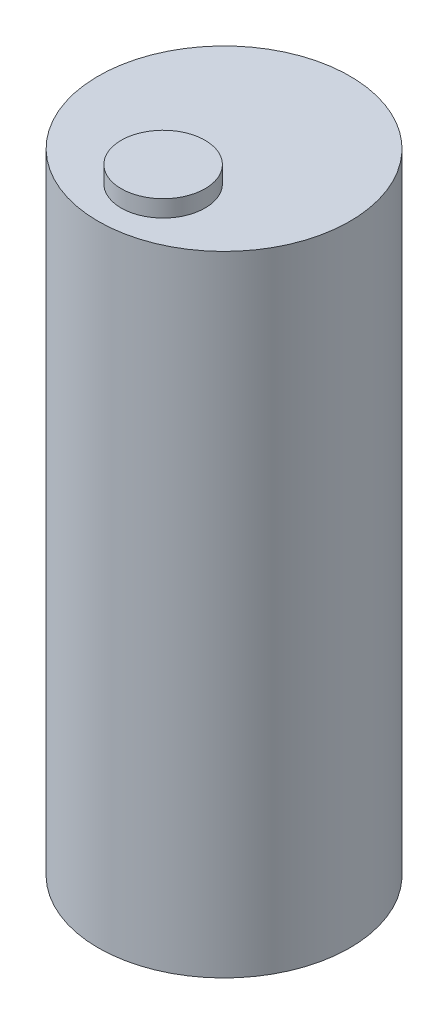
ISO-10303-21;
HEADER;
FILE_DESCRIPTION(('STEP AP214'),'2;1');
FILE_NAME('part.step','',(''),(''),'','','');
FILE_SCHEMA(('AUTOMOTIVE_DESIGN { 1 0 10303 214 1 1 1 1 }'));
ENDSEC;
DATA;
#1=APPLICATION_CONTEXT('core data for automotive mechanical design processes');
#2=APPLICATION_PROTOCOL_DEFINITION('international standard','automotive_design',2000,#1);
#3=PRODUCT_CONTEXT('',#1,'mechanical');
#4=PRODUCT('Part','Part','',(#3));
#5=PRODUCT_RELATED_PRODUCT_CATEGORY('part','',(#4));
#6=PRODUCT_DEFINITION_FORMATION('','',#4);
#7=PRODUCT_DEFINITION_CONTEXT('part definition',#1,'design');
#8=PRODUCT_DEFINITION('design','',#6,#7);
#9=PRODUCT_DEFINITION_SHAPE('','',#8);
#10=(LENGTH_UNIT() NAMED_UNIT(*) SI_UNIT(.MILLI.,.METRE.));
#11=(NAMED_UNIT(*) PLANE_ANGLE_UNIT() SI_UNIT($,.RADIAN.));
#12=(NAMED_UNIT(*) SI_UNIT($,.STERADIAN.) SOLID_ANGLE_UNIT());
#13=UNCERTAINTY_MEASURE_WITH_UNIT(LENGTH_MEASURE(1.E-05),#10,'distance_accuracy_value','');
#14=(GEOMETRIC_REPRESENTATION_CONTEXT(3) GLOBAL_UNCERTAINTY_ASSIGNED_CONTEXT((#13)) GLOBAL_UNIT_ASSIGNED_CONTEXT((#10,
#11,#12)) REPRESENTATION_CONTEXT('',''));
#15=CARTESIAN_POINT('',(0.,0.,0.));
#16=DIRECTION('',(0.,0.,1.));
#17=DIRECTION('',(1.,0.,0.));
#18=AXIS2_PLACEMENT_3D('',#15,#16,#17);
#19=CARTESIAN_POINT('',(0.,75.,0.));
#20=DIRECTION('',(0.,-1.,0.));
#21=DIRECTION('',(0.,0.,-1.));
#22=AXIS2_PLACEMENT_3D('',#19,#20,#21);
#23=CYLINDRICAL_SURFACE('',#22,15.);
#24=CARTESIAN_POINT('',(0.,75.,0.));
#25=DIRECTION('',(0.,1.,0.));
#26=DIRECTION('',(0.,0.,1.));
#27=AXIS2_PLACEMENT_3D('',#24,#25,#26);
#28=CIRCLE('',#27,15.);
#29=CARTESIAN_POINT('',(0.,75.,15.));
#30=VERTEX_POINT('',#29);
#31=EDGE_CURVE('E10',#30,#30,#28,.T.);
#32=ORIENTED_EDGE('',*,*,#31,.F.);
#33=EDGE_LOOP('',(#32));
#34=FACE_BOUND('',#33,.T.);
#35=CARTESIAN_POINT('',(0.,0.,0.));
#36=DIRECTION('',(0.,1.,0.));
#37=DIRECTION('',(0.,0.,1.));
#38=AXIS2_PLACEMENT_3D('',#35,#36,#37);
#39=CIRCLE('',#38,15.);
#40=CARTESIAN_POINT('',(0.,0.,15.));
#41=VERTEX_POINT('',#40);
#42=EDGE_CURVE('E33',#41,#41,#39,.T.);
#43=ORIENTED_EDGE('',*,*,#42,.T.);
#44=EDGE_LOOP('',(#43));
#45=FACE_BOUND('',#44,.T.);
#46=ADVANCED_FACE('F30',(#34,#45),#23,.T.);
#47=CARTESIAN_POINT('',(0.,75.,0.));
#48=DIRECTION('',(0.,1.,0.));
#49=DIRECTION('',(0.,0.,1.));
#50=AXIS2_PLACEMENT_3D('',#47,#48,#49);
#51=PLANE('',#50);
#52=CARTESIAN_POINT('',(0.,75.,7.25976365104941));
#53=DIRECTION('',(0.,1.,0.));
#54=DIRECTION('',(0.,0.,1.));
#55=AXIS2_PLACEMENT_3D('',#52,#53,#54);
#56=CIRCLE('',#55,5.);
#57=CARTESIAN_POINT('',(0.,75.,12.2597636510494));
#58=VERTEX_POINT('',#57);
#59=EDGE_CURVE('E42',#58,#58,#56,.T.);
#60=ORIENTED_EDGE('',*,*,#59,.F.);
#61=EDGE_LOOP('',(#60));
#62=FACE_BOUND('',#61,.T.);
#63=ORIENTED_EDGE('',*,*,#31,.T.);
#64=EDGE_LOOP('',(#63));
#65=FACE_BOUND('',#64,.T.);
#66=ADVANCED_FACE('F57',(#62,#65),#51,.T.);
#67=CARTESIAN_POINT('',(0.,0.,0.));
#68=DIRECTION('',(0.,1.,0.));
#69=DIRECTION('',(0.,0.,1.));
#70=AXIS2_PLACEMENT_3D('',#67,#68,#69);
#71=PLANE('',#70);
#72=ORIENTED_EDGE('',*,*,#42,.F.);
#73=EDGE_LOOP('',(#72));
#74=FACE_BOUND('',#73,.T.);
#75=ADVANCED_FACE('F53',(#74),#71,.F.);
#76=CARTESIAN_POINT('',(0.,77.,7.25976365104941));
#77=DIRECTION('',(0.,-1.,0.));
#78=DIRECTION('',(0.,0.,-1.));
#79=AXIS2_PLACEMENT_3D('',#76,#77,#78);
#80=CYLINDRICAL_SURFACE('',#79,5.);
#81=CARTESIAN_POINT('',(0.,77.,7.25976365104941));
#82=DIRECTION('',(0.,1.,0.));
#83=DIRECTION('',(0.,0.,1.));
#84=AXIS2_PLACEMENT_3D('',#81,#82,#83);
#85=CIRCLE('',#84,5.);
#86=CARTESIAN_POINT('',(0.,77.,12.2597636510494));
#87=VERTEX_POINT('',#86);
#88=EDGE_CURVE('E40',#87,#87,#85,.T.);
#89=ORIENTED_EDGE('',*,*,#88,.F.);
#90=EDGE_LOOP('',(#89));
#91=FACE_BOUND('',#90,.T.);
#92=ORIENTED_EDGE('',*,*,#59,.T.);
#93=EDGE_LOOP('',(#92));
#94=FACE_BOUND('',#93,.T.);
#95=ADVANCED_FACE('F50',(#91,#94),#80,.T.);
#96=CARTESIAN_POINT('',(0.,77.,7.25976365104941));
#97=DIRECTION('',(0.,1.,0.));
#98=DIRECTION('',(0.,0.,1.));
#99=AXIS2_PLACEMENT_3D('',#96,#97,#98);
#100=PLANE('',#99);
#101=ORIENTED_EDGE('',*,*,#88,.T.);
#102=EDGE_LOOP('',(#101));
#103=FACE_BOUND('',#102,.T.);
#104=ADVANCED_FACE('F48',(#103),#100,.T.);
#105=CLOSED_SHELL('',(#46,#66,#75,#95,#104));
#106=MANIFOLD_SOLID_BREP('B2',#105);
#107=ADVANCED_BREP_SHAPE_REPRESENTATION('',(#18,#106),#14);
#108=SHAPE_DEFINITION_REPRESENTATION(#9,#107);
ENDSEC;
END-ISO-10303-21;
